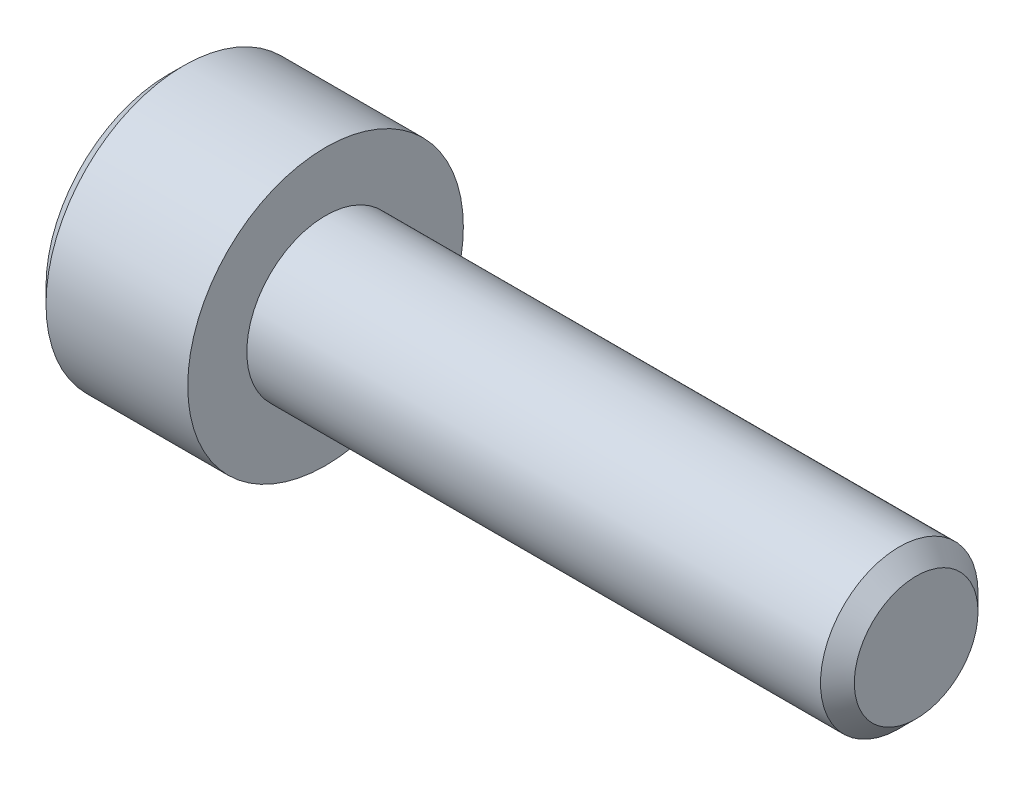
ISO-10303-21;
HEADER;
FILE_DESCRIPTION(('STEP AP214'),'2;1');
FILE_NAME('part.step','',(''),(''),'','','');
FILE_SCHEMA(('AUTOMOTIVE_DESIGN { 1 0 10303 214 1 1 1 1 }'));
ENDSEC;
DATA;
#1=APPLICATION_CONTEXT('core data for automotive mechanical design processes');
#2=APPLICATION_PROTOCOL_DEFINITION('international standard','automotive_design',2000,#1);
#3=PRODUCT_CONTEXT('',#1,'mechanical');
#4=PRODUCT('Part','Part','',(#3));
#5=PRODUCT_RELATED_PRODUCT_CATEGORY('part','',(#4));
#6=PRODUCT_DEFINITION_FORMATION('','',#4);
#7=PRODUCT_DEFINITION_CONTEXT('part definition',#1,'design');
#8=PRODUCT_DEFINITION('design','',#6,#7);
#9=PRODUCT_DEFINITION_SHAPE('','',#8);
#10=(LENGTH_UNIT() NAMED_UNIT(*) SI_UNIT(.MILLI.,.METRE.));
#11=(NAMED_UNIT(*) PLANE_ANGLE_UNIT() SI_UNIT($,.RADIAN.));
#12=(NAMED_UNIT(*) SI_UNIT($,.STERADIAN.) SOLID_ANGLE_UNIT());
#13=UNCERTAINTY_MEASURE_WITH_UNIT(LENGTH_MEASURE(1.E-05),#10,'distance_accuracy_value','');
#14=(GEOMETRIC_REPRESENTATION_CONTEXT(3) GLOBAL_UNCERTAINTY_ASSIGNED_CONTEXT((#13)) GLOBAL_UNIT_ASSIGNED_CONTEXT((#10,
#11,#12)) REPRESENTATION_CONTEXT('',''));
#15=CARTESIAN_POINT('',(0.,0.,0.));
#16=DIRECTION('',(0.,0.,1.));
#17=DIRECTION('',(1.,0.,0.));
#18=AXIS2_PLACEMENT_3D('',#15,#16,#17);
#19=CARTESIAN_POINT('',(-2.,0.,0.));
#20=DIRECTION('',(-1.,0.,0.));
#21=DIRECTION('',(0.,0.,1.));
#22=AXIS2_PLACEMENT_3D('',#19,#20,#21);
#23=CONICAL_SURFACE('',#22,1.5,1.30899693899575);
#24=CARTESIAN_POINT('',(-2.,0.,0.));
#25=DIRECTION('',(1.,0.,0.));
#26=DIRECTION('',(0.,0.,-1.));
#27=AXIS2_PLACEMENT_3D('',#24,#25,#26);
#28=CIRCLE('',#27,1.5);
#29=CARTESIAN_POINT('',(-2.,1.29903810567666,-0.75));
#30=VERTEX_POINT('',#29);
#31=CARTESIAN_POINT('',(-2.,1.29903810567666,0.75));
#32=VERTEX_POINT('',#31);
#33=EDGE_CURVE('E213',#30,#32,#28,.T.);
#34=ORIENTED_EDGE('',*,*,#33,.F.);
#35=CARTESIAN_POINT('',(-2.,0.,0.));
#36=DIRECTION('',(1.,0.,0.));
#37=DIRECTION('',(0.,0.,-1.));
#38=AXIS2_PLACEMENT_3D('',#35,#36,#37);
#39=CIRCLE('',#38,1.5);
#40=CARTESIAN_POINT('',(-2.,0.,-1.5));
#41=VERTEX_POINT('',#40);
#42=EDGE_CURVE('E117',#41,#30,#39,.T.);
#43=ORIENTED_EDGE('',*,*,#42,.F.);
#44=CARTESIAN_POINT('',(-2.,0.,0.));
#45=DIRECTION('',(1.,0.,0.));
#46=DIRECTION('',(0.,0.,-1.));
#47=AXIS2_PLACEMENT_3D('',#44,#45,#46);
#48=CIRCLE('',#47,1.5);
#49=CARTESIAN_POINT('',(-2.,-1.29903810567666,-0.75));
#50=VERTEX_POINT('',#49);
#51=EDGE_CURVE('E10',#50,#41,#48,.T.);
#52=ORIENTED_EDGE('',*,*,#51,.F.);
#53=CARTESIAN_POINT('',(-2.,0.,0.));
#54=DIRECTION('',(1.,0.,0.));
#55=DIRECTION('',(0.,0.,-1.));
#56=AXIS2_PLACEMENT_3D('',#53,#54,#55);
#57=CIRCLE('',#56,1.5);
#58=CARTESIAN_POINT('',(-2.,-1.29903810567666,0.75));
#59=VERTEX_POINT('',#58);
#60=EDGE_CURVE('E26',#59,#50,#57,.T.);
#61=ORIENTED_EDGE('',*,*,#60,.F.);
#62=CARTESIAN_POINT('',(-2.,0.,0.));
#63=DIRECTION('',(1.,0.,0.));
#64=DIRECTION('',(0.,0.,-1.));
#65=AXIS2_PLACEMENT_3D('',#62,#63,#64);
#66=CIRCLE('',#65,1.5);
#67=CARTESIAN_POINT('',(-2.,0.,1.5));
#68=VERTEX_POINT('',#67);
#69=EDGE_CURVE('E131',#68,#59,#66,.T.);
#70=ORIENTED_EDGE('',*,*,#69,.F.);
#71=CARTESIAN_POINT('',(-2.,0.,0.));
#72=DIRECTION('',(1.,0.,0.));
#73=DIRECTION('',(0.,0.,-1.));
#74=AXIS2_PLACEMENT_3D('',#71,#72,#73);
#75=CIRCLE('',#74,1.5);
#76=EDGE_CURVE('E40',#32,#68,#75,.T.);
#77=ORIENTED_EDGE('',*,*,#76,.F.);
#78=EDGE_LOOP('',(#34,#43,#52,#61,#70,#77));
#79=FACE_BOUND('',#78,.T.);
#80=CARTESIAN_POINT('',(-1.59807621135332,0.,0.));
#81=VERTEX_POINT('',#80);
#82=VERTEX_LOOP('',#81);
#83=FACE_BOUND('',#82,.T.);
#84=ADVANCED_FACE('F15',(#79,#83),#23,.F.);
#85=CARTESIAN_POINT('',(-2.,0.,0.));
#86=DIRECTION('',(1.,0.,0.));
#87=DIRECTION('',(0.,1.,0.));
#88=AXIS2_PLACEMENT_3D('',#85,#86,#87);
#89=PLANE('',#88);
#90=ORIENTED_EDGE('',*,*,#51,.T.);
#91=DIRECTION('',(0.,1.,0.));
#92=VECTOR('',#91,1.);
#93=CARTESIAN_POINT('',(-2.,-0.866025403784439,-1.5));
#94=LINE('',#93,#92);
#95=CARTESIAN_POINT('',(-2.,-0.866025403784439,-1.5));
#96=VERTEX_POINT('',#95);
#97=EDGE_CURVE('E137',#96,#41,#94,.T.);
#98=ORIENTED_EDGE('',*,*,#97,.F.);
#99=DIRECTION('',(0.,0.5,-0.866025403784439));
#100=VECTOR('',#99,1.);
#101=CARTESIAN_POINT('',(-2.,-1.73205080756888,0.));
#102=LINE('',#101,#100);
#103=EDGE_CURVE('E134',#50,#96,#102,.T.);
#104=ORIENTED_EDGE('',*,*,#103,.F.);
#105=EDGE_LOOP('',(#90,#98,#104));
#106=FACE_BOUND('',#105,.T.);
#107=ADVANCED_FACE('F135',(#106),#89,.F.);
#108=CARTESIAN_POINT('',(-2.,0.,0.));
#109=DIRECTION('',(1.,0.,0.));
#110=DIRECTION('',(0.,1.,0.));
#111=AXIS2_PLACEMENT_3D('',#108,#109,#110);
#112=PLANE('',#111);
#113=ORIENTED_EDGE('',*,*,#60,.T.);
#114=DIRECTION('',(0.,0.5,-0.866025403784439));
#115=VECTOR('',#114,1.);
#116=CARTESIAN_POINT('',(-2.,-1.73205080756888,0.));
#117=LINE('',#116,#115);
#118=CARTESIAN_POINT('',(-2.,-1.73205080756888,0.));
#119=VERTEX_POINT('',#118);
#120=EDGE_CURVE('E125',#119,#50,#117,.T.);
#121=ORIENTED_EDGE('',*,*,#120,.F.);
#122=DIRECTION('',(0.,-0.5,-0.866025403784439));
#123=VECTOR('',#122,1.);
#124=CARTESIAN_POINT('',(-2.,-0.866025403784439,1.5));
#125=LINE('',#124,#123);
#126=EDGE_CURVE('E128',#59,#119,#125,.T.);
#127=ORIENTED_EDGE('',*,*,#126,.F.);
#128=EDGE_LOOP('',(#113,#121,#127));
#129=FACE_BOUND('',#128,.T.);
#130=ADVANCED_FACE('F123',(#129),#112,.F.);
#131=CARTESIAN_POINT('',(-2.,0.,0.));
#132=DIRECTION('',(1.,0.,0.));
#133=DIRECTION('',(0.,1.,0.));
#134=AXIS2_PLACEMENT_3D('',#131,#132,#133);
#135=PLANE('',#134);
#136=ORIENTED_EDGE('',*,*,#69,.T.);
#137=DIRECTION('',(0.,-0.5,-0.866025403784439));
#138=VECTOR('',#137,1.);
#139=CARTESIAN_POINT('',(-2.,-0.866025403784439,1.5));
#140=LINE('',#139,#138);
#141=CARTESIAN_POINT('',(-2.,-0.866025403784439,1.5));
#142=VERTEX_POINT('',#141);
#143=EDGE_CURVE('E157',#142,#59,#140,.T.);
#144=ORIENTED_EDGE('',*,*,#143,.F.);
#145=DIRECTION('',(0.,-1.,0.));
#146=VECTOR('',#145,1.);
#147=CARTESIAN_POINT('',(-2.,0.866025403784439,1.5));
#148=LINE('',#147,#146);
#149=EDGE_CURVE('E164',#68,#142,#148,.T.);
#150=ORIENTED_EDGE('',*,*,#149,.F.);
#151=EDGE_LOOP('',(#136,#144,#150));
#152=FACE_BOUND('',#151,.T.);
#153=ADVANCED_FACE('F342',(#152),#135,.F.);
#154=CARTESIAN_POINT('',(-2.,0.,0.));
#155=DIRECTION('',(1.,0.,0.));
#156=DIRECTION('',(0.,1.,0.));
#157=AXIS2_PLACEMENT_3D('',#154,#155,#156);
#158=PLANE('',#157);
#159=ORIENTED_EDGE('',*,*,#76,.T.);
#160=DIRECTION('',(0.,-1.,0.));
#161=VECTOR('',#160,1.);
#162=CARTESIAN_POINT('',(-2.,0.866025403784439,1.5));
#163=LINE('',#162,#161);
#164=CARTESIAN_POINT('',(-2.,0.866025403784439,1.5));
#165=VERTEX_POINT('',#164);
#166=EDGE_CURVE('E155',#165,#68,#163,.T.);
#167=ORIENTED_EDGE('',*,*,#166,.F.);
#168=DIRECTION('',(0.,-0.5,0.866025403784439));
#169=VECTOR('',#168,1.);
#170=CARTESIAN_POINT('',(-2.,1.73205080756888,0.));
#171=LINE('',#170,#169);
#172=EDGE_CURVE('E247',#32,#165,#171,.T.);
#173=ORIENTED_EDGE('',*,*,#172,.F.);
#174=EDGE_LOOP('',(#159,#167,#173));
#175=FACE_BOUND('',#174,.T.);
#176=ADVANCED_FACE('F345',(#175),#158,.F.);
#177=CARTESIAN_POINT('',(-2.,0.,0.));
#178=DIRECTION('',(1.,0.,0.));
#179=DIRECTION('',(0.,1.,0.));
#180=AXIS2_PLACEMENT_3D('',#177,#178,#179);
#181=PLANE('',#180);
#182=DIRECTION('',(0.,0.5,0.866025403784439));
#183=VECTOR('',#182,1.);
#184=CARTESIAN_POINT('',(-2.,0.866025403784439,-1.5));
#185=LINE('',#184,#183);
#186=CARTESIAN_POINT('',(-2.,1.73205080756888,0.));
#187=VERTEX_POINT('',#186);
#188=EDGE_CURVE('E181',#30,#187,#185,.T.);
#189=ORIENTED_EDGE('',*,*,#188,.F.);
#190=ORIENTED_EDGE('',*,*,#33,.T.);
#191=DIRECTION('',(0.,-0.5,0.866025403784439));
#192=VECTOR('',#191,1.);
#193=CARTESIAN_POINT('',(-2.,1.73205080756888,0.));
#194=LINE('',#193,#192);
#195=EDGE_CURVE('E202',#187,#32,#194,.T.);
#196=ORIENTED_EDGE('',*,*,#195,.F.);
#197=EDGE_LOOP('',(#189,#190,#196));
#198=FACE_BOUND('',#197,.T.);
#199=ADVANCED_FACE('F340',(#198),#181,.F.);
#200=CARTESIAN_POINT('',(-2.,0.,0.));
#201=DIRECTION('',(1.,0.,0.));
#202=DIRECTION('',(0.,1.,0.));
#203=AXIS2_PLACEMENT_3D('',#200,#201,#202);
#204=PLANE('',#203);
#205=ORIENTED_EDGE('',*,*,#42,.T.);
#206=DIRECTION('',(0.,0.5,0.866025403784439));
#207=VECTOR('',#206,1.);
#208=CARTESIAN_POINT('',(-2.,0.866025403784439,-1.5));
#209=LINE('',#208,#207);
#210=CARTESIAN_POINT('',(-2.,0.866025403784438,-1.5));
#211=VERTEX_POINT('',#210);
#212=EDGE_CURVE('E186',#211,#30,#209,.T.);
#213=ORIENTED_EDGE('',*,*,#212,.F.);
#214=DIRECTION('',(0.,1.,0.));
#215=VECTOR('',#214,1.);
#216=CARTESIAN_POINT('',(-2.,-0.866025403784439,-1.5));
#217=LINE('',#216,#215);
#218=EDGE_CURVE('E163',#41,#211,#217,.T.);
#219=ORIENTED_EDGE('',*,*,#218,.F.);
#220=EDGE_LOOP('',(#205,#213,#219));
#221=FACE_BOUND('',#220,.T.);
#222=ADVANCED_FACE('F335',(#221),#204,.F.);
#223=CARTESIAN_POINT('',(-2.,1.73205080756888,0.));
#224=DIRECTION('',(0.,-0.866025403784439,-0.5));
#225=DIRECTION('',(0.,0.5,-0.866025403784439));
#226=AXIS2_PLACEMENT_3D('',#223,#224,#225);
#227=PLANE('',#226);
#228=DIRECTION('',(0.,-0.5,0.866025403784439));
#229=VECTOR('',#228,1.);
#230=CARTESIAN_POINT('',(-4.,1.73205080756888,0.));
#231=LINE('',#230,#229);
#232=CARTESIAN_POINT('',(-4.,1.73205080756888,0.));
#233=VERTEX_POINT('',#232);
#234=CARTESIAN_POINT('',(-4.,0.866025403784439,1.5));
#235=VERTEX_POINT('',#234);
#236=EDGE_CURVE('E174',#233,#235,#231,.T.);
#237=ORIENTED_EDGE('',*,*,#236,.F.);
#238=DIRECTION('',(-1.,0.,0.));
#239=VECTOR('',#238,1.);
#240=CARTESIAN_POINT('',(-2.,1.73205080756888,0.));
#241=LINE('',#240,#239);
#242=EDGE_CURVE('E185',#187,#233,#241,.T.);
#243=ORIENTED_EDGE('',*,*,#242,.F.);
#244=ORIENTED_EDGE('',*,*,#195,.T.);
#245=ORIENTED_EDGE('',*,*,#172,.T.);
#246=DIRECTION('',(-1.,0.,0.));
#247=VECTOR('',#246,1.);
#248=CARTESIAN_POINT('',(-2.,0.866025403784439,1.5));
#249=LINE('',#248,#247);
#250=EDGE_CURVE('E219',#165,#235,#249,.T.);
#251=ORIENTED_EDGE('',*,*,#250,.T.);
#252=EDGE_LOOP('',(#237,#243,#244,#245,#251));
#253=FACE_BOUND('',#252,.T.);
#254=ADVANCED_FACE('F274',(#253),#227,.T.);
#255=CARTESIAN_POINT('',(-2.,0.866025403784439,-1.5));
#256=DIRECTION('',(0.,-0.866025403784439,0.5));
#257=DIRECTION('',(-1.,0.,0.));
#258=AXIS2_PLACEMENT_3D('',#255,#256,#257);
#259=PLANE('',#258);
#260=DIRECTION('',(0.,0.5,0.866025403784439));
#261=VECTOR('',#260,1.);
#262=CARTESIAN_POINT('',(-4.,0.866025403784439,-1.5));
#263=LINE('',#262,#261);
#264=CARTESIAN_POINT('',(-4.,0.866025403784438,-1.5));
#265=VERTEX_POINT('',#264);
#266=EDGE_CURVE('E172',#265,#233,#263,.T.);
#267=ORIENTED_EDGE('',*,*,#266,.F.);
#268=DIRECTION('',(-1.,0.,0.));
#269=VECTOR('',#268,1.);
#270=CARTESIAN_POINT('',(-2.,0.866025403784438,-1.5));
#271=LINE('',#270,#269);
#272=EDGE_CURVE('E210',#211,#265,#271,.T.);
#273=ORIENTED_EDGE('',*,*,#272,.F.);
#274=ORIENTED_EDGE('',*,*,#212,.T.);
#275=ORIENTED_EDGE('',*,*,#188,.T.);
#276=ORIENTED_EDGE('',*,*,#242,.T.);
#277=EDGE_LOOP('',(#267,#273,#274,#275,#276));
#278=FACE_BOUND('',#277,.T.);
#279=ADVANCED_FACE('F334',(#278),#259,.T.);
#280=CARTESIAN_POINT('',(-2.,-0.866025403784439,-1.5));
#281=DIRECTION('',(0.,0.,1.));
#282=DIRECTION('',(1.,0.,0.));
#283=AXIS2_PLACEMENT_3D('',#280,#281,#282);
#284=PLANE('',#283);
#285=DIRECTION('',(0.,1.,0.));
#286=VECTOR('',#285,1.);
#287=CARTESIAN_POINT('',(-4.,-0.866025403784439,-1.5));
#288=LINE('',#287,#286);
#289=CARTESIAN_POINT('',(-4.,-0.866025403784439,-1.5));
#290=VERTEX_POINT('',#289);
#291=EDGE_CURVE('E168',#290,#265,#288,.T.);
#292=ORIENTED_EDGE('',*,*,#291,.F.);
#293=DIRECTION('',(-1.,0.,0.));
#294=VECTOR('',#293,1.);
#295=CARTESIAN_POINT('',(-2.,-0.866025403784439,-1.5));
#296=LINE('',#295,#294);
#297=EDGE_CURVE('E141',#96,#290,#296,.T.);
#298=ORIENTED_EDGE('',*,*,#297,.F.);
#299=ORIENTED_EDGE('',*,*,#97,.T.);
#300=ORIENTED_EDGE('',*,*,#218,.T.);
#301=ORIENTED_EDGE('',*,*,#272,.T.);
#302=EDGE_LOOP('',(#292,#298,#299,#300,#301));
#303=FACE_BOUND('',#302,.T.);
#304=ADVANCED_FACE('F304',(#303),#284,.T.);
#305=CARTESIAN_POINT('',(-2.,-1.73205080756888,0.));
#306=DIRECTION('',(0.,0.866025403784439,0.5));
#307=DIRECTION('',(1.,0.,0.));
#308=AXIS2_PLACEMENT_3D('',#305,#306,#307);
#309=PLANE('',#308);
#310=DIRECTION('',(0.,0.5,-0.866025403784439));
#311=VECTOR('',#310,1.);
#312=CARTESIAN_POINT('',(-4.,-1.73205080756888,0.));
#313=LINE('',#312,#311);
#314=CARTESIAN_POINT('',(-4.,-1.73205080756888,0.));
#315=VERTEX_POINT('',#314);
#316=EDGE_CURVE('E173',#315,#290,#313,.T.);
#317=ORIENTED_EDGE('',*,*,#316,.F.);
#318=DIRECTION('',(-1.,0.,0.));
#319=VECTOR('',#318,1.);
#320=CARTESIAN_POINT('',(-2.,-1.73205080756888,0.));
#321=LINE('',#320,#319);
#322=EDGE_CURVE('E145',#119,#315,#321,.T.);
#323=ORIENTED_EDGE('',*,*,#322,.F.);
#324=ORIENTED_EDGE('',*,*,#120,.T.);
#325=ORIENTED_EDGE('',*,*,#103,.T.);
#326=ORIENTED_EDGE('',*,*,#297,.T.);
#327=EDGE_LOOP('',(#317,#323,#324,#325,#326));
#328=FACE_BOUND('',#327,.T.);
#329=ADVANCED_FACE('F144',(#328),#309,.T.);
#330=CARTESIAN_POINT('',(-2.,-0.866025403784439,1.5));
#331=DIRECTION('',(0.,0.866025403784439,-0.5));
#332=DIRECTION('',(-1.,0.,0.));
#333=AXIS2_PLACEMENT_3D('',#330,#331,#332);
#334=PLANE('',#333);
#335=DIRECTION('',(0.,-0.5,-0.866025403784439));
#336=VECTOR('',#335,1.);
#337=CARTESIAN_POINT('',(-4.,-0.866025403784439,1.5));
#338=LINE('',#337,#336);
#339=CARTESIAN_POINT('',(-4.,-0.866025403784439,1.5));
#340=VERTEX_POINT('',#339);
#341=EDGE_CURVE('E187',#340,#315,#338,.T.);
#342=ORIENTED_EDGE('',*,*,#341,.F.);
#343=DIRECTION('',(-1.,0.,0.));
#344=VECTOR('',#343,1.);
#345=CARTESIAN_POINT('',(-2.,-0.866025403784439,1.5));
#346=LINE('',#345,#344);
#347=EDGE_CURVE('E160',#142,#340,#346,.T.);
#348=ORIENTED_EDGE('',*,*,#347,.F.);
#349=ORIENTED_EDGE('',*,*,#143,.T.);
#350=ORIENTED_EDGE('',*,*,#126,.T.);
#351=ORIENTED_EDGE('',*,*,#322,.T.);
#352=EDGE_LOOP('',(#342,#348,#349,#350,#351));
#353=FACE_BOUND('',#352,.T.);
#354=ADVANCED_FACE('F17',(#353),#334,.T.);
#355=CARTESIAN_POINT('',(-2.,0.866025403784439,1.5));
#356=DIRECTION('',(0.,0.,-1.));
#357=DIRECTION('',(0.,-1.,0.));
#358=AXIS2_PLACEMENT_3D('',#355,#356,#357);
#359=PLANE('',#358);
#360=DIRECTION('',(0.,-1.,0.));
#361=VECTOR('',#360,1.);
#362=CARTESIAN_POINT('',(-4.,0.866025403784439,1.5));
#363=LINE('',#362,#361);
#364=EDGE_CURVE('E178',#235,#340,#363,.T.);
#365=ORIENTED_EDGE('',*,*,#364,.F.);
#366=ORIENTED_EDGE('',*,*,#250,.F.);
#367=ORIENTED_EDGE('',*,*,#166,.T.);
#368=ORIENTED_EDGE('',*,*,#149,.T.);
#369=ORIENTED_EDGE('',*,*,#347,.T.);
#370=EDGE_LOOP('',(#365,#366,#367,#368,#369));
#371=FACE_BOUND('',#370,.T.);
#372=ADVANCED_FACE('F263',(#371),#359,.T.);
#373=CARTESIAN_POINT('',(15.,1.5705,0.));
#374=DIRECTION('',(-1.,0.,0.));
#375=DIRECTION('',(0.,0.,1.));
#376=AXIS2_PLACEMENT_3D('',#373,#374,#375);
#377=PLANE('',#376);
#378=CARTESIAN_POINT('',(15.,0.,0.));
#379=DIRECTION('',(1.,0.,0.));
#380=DIRECTION('',(0.,0.,-1.));
#381=AXIS2_PLACEMENT_3D('',#378,#379,#380);
#382=CIRCLE('',#381,1.5705);
#383=CARTESIAN_POINT('',(15.,0.,-1.5705));
#384=VERTEX_POINT('',#383);
#385=EDGE_CURVE('E195',#384,#384,#382,.T.);
#386=ORIENTED_EDGE('',*,*,#385,.T.);
#387=EDGE_LOOP('',(#386));
#388=FACE_BOUND('',#387,.T.);
#389=ADVANCED_FACE('F318',(#388),#377,.F.);
#390=CARTESIAN_POINT('',(14.5705,0.,0.));
#391=DIRECTION('',(-1.,0.,0.));
#392=DIRECTION('',(0.,0.,1.));
#393=AXIS2_PLACEMENT_3D('',#390,#391,#392);
#394=CONICAL_SURFACE('',#393,2.,0.785398163397449);
#395=CARTESIAN_POINT('',(14.5705,0.,0.));
#396=DIRECTION('',(1.,0.,0.));
#397=DIRECTION('',(0.,0.,-1.));
#398=AXIS2_PLACEMENT_3D('',#395,#396,#397);
#399=CIRCLE('',#398,2.);
#400=CARTESIAN_POINT('',(14.5705,0.,-2.));
#401=VERTEX_POINT('',#400);
#402=EDGE_CURVE('E192',#401,#401,#399,.T.);
#403=ORIENTED_EDGE('',*,*,#402,.T.);
#404=EDGE_LOOP('',(#403));
#405=FACE_BOUND('',#404,.T.);
#406=ORIENTED_EDGE('',*,*,#385,.F.);
#407=EDGE_LOOP('',(#406));
#408=FACE_BOUND('',#407,.T.);
#409=ADVANCED_FACE('F310',(#405,#408),#394,.T.);
#410=CARTESIAN_POINT('',(15.,0.,0.));
#411=DIRECTION('',(1.,0.,0.));
#412=DIRECTION('',(0.,0.,-1.));
#413=AXIS2_PLACEMENT_3D('',#410,#411,#412);
#414=CYLINDRICAL_SURFACE('',#413,2.);
#415=CARTESIAN_POINT('',(0.,0.,0.));
#416=DIRECTION('',(1.,0.,0.));
#417=DIRECTION('',(0.,0.,-1.));
#418=AXIS2_PLACEMENT_3D('',#415,#416,#417);
#419=CIRCLE('',#418,2.);
#420=CARTESIAN_POINT('',(0.,0.,-2.));
#421=VERTEX_POINT('',#420);
#422=EDGE_CURVE('E196',#421,#421,#419,.T.);
#423=ORIENTED_EDGE('',*,*,#422,.T.);
#424=EDGE_LOOP('',(#423));
#425=FACE_BOUND('',#424,.T.);
#426=ORIENTED_EDGE('',*,*,#402,.F.);
#427=EDGE_LOOP('',(#426));
#428=FACE_BOUND('',#427,.T.);
#429=ADVANCED_FACE('F306',(#425,#428),#414,.T.);
#430=CARTESIAN_POINT('',(0.,3.5,0.));
#431=DIRECTION('',(-1.,0.,0.));
#432=DIRECTION('',(0.,0.,1.));
#433=AXIS2_PLACEMENT_3D('',#430,#431,#432);
#434=PLANE('',#433);
#435=CARTESIAN_POINT('',(0.,0.,0.));
#436=DIRECTION('',(1.,0.,0.));
#437=DIRECTION('',(0.,0.,-1.));
#438=AXIS2_PLACEMENT_3D('',#435,#436,#437);
#439=CIRCLE('',#438,3.5);
#440=CARTESIAN_POINT('',(0.,0.,-3.5));
#441=VERTEX_POINT('',#440);
#442=EDGE_CURVE('E19',#441,#441,#439,.T.);
#443=ORIENTED_EDGE('',*,*,#442,.T.);
#444=EDGE_LOOP('',(#443));
#445=FACE_BOUND('',#444,.T.);
#446=ORIENTED_EDGE('',*,*,#422,.F.);
#447=EDGE_LOOP('',(#446));
#448=FACE_BOUND('',#447,.T.);
#449=ADVANCED_FACE('F309',(#445,#448),#434,.F.);
#450=CARTESIAN_POINT('',(15.,0.,0.));
#451=DIRECTION('',(1.,0.,0.));
#452=DIRECTION('',(0.,0.,-1.));
#453=AXIS2_PLACEMENT_3D('',#450,#451,#452);
#454=CYLINDRICAL_SURFACE('',#453,3.5);
#455=CARTESIAN_POINT('',(-3.6,0.,0.));
#456=DIRECTION('',(1.,0.,0.));
#457=DIRECTION('',(0.,0.,-1.));
#458=AXIS2_PLACEMENT_3D('',#455,#456,#457);
#459=CIRCLE('',#458,3.5);
#460=CARTESIAN_POINT('',(-3.6,0.,-3.5));
#461=VERTEX_POINT('',#460);
#462=EDGE_CURVE('E191',#461,#461,#459,.T.);
#463=ORIENTED_EDGE('',*,*,#462,.T.);
#464=EDGE_LOOP('',(#463));
#465=FACE_BOUND('',#464,.T.);
#466=ORIENTED_EDGE('',*,*,#442,.F.);
#467=EDGE_LOOP('',(#466));
#468=FACE_BOUND('',#467,.T.);
#469=ADVANCED_FACE('F314',(#465,#468),#454,.T.);
#470=CARTESIAN_POINT('',(-4.,0.,0.));
#471=DIRECTION('',(1.,0.,0.));
#472=DIRECTION('',(0.,0.,-1.));
#473=AXIS2_PLACEMENT_3D('',#470,#471,#472);
#474=CONICAL_SURFACE('',#473,3.1,0.785398163397447);
#475=CARTESIAN_POINT('',(-4.,0.,0.));
#476=DIRECTION('',(1.,0.,0.));
#477=DIRECTION('',(0.,0.,-1.));
#478=AXIS2_PLACEMENT_3D('',#475,#476,#477);
#479=CIRCLE('',#478,3.1);
#480=CARTESIAN_POINT('',(-4.,0.,-3.1));
#481=VERTEX_POINT('',#480);
#482=EDGE_CURVE('E225',#481,#481,#479,.T.);
#483=ORIENTED_EDGE('',*,*,#482,.T.);
#484=EDGE_LOOP('',(#483));
#485=FACE_BOUND('',#484,.T.);
#486=ORIENTED_EDGE('',*,*,#462,.F.);
#487=EDGE_LOOP('',(#486));
#488=FACE_BOUND('',#487,.T.);
#489=ADVANCED_FACE('F319',(#485,#488),#474,.T.);
#490=CARTESIAN_POINT('',(-4.,0.,0.));
#491=DIRECTION('',(1.,0.,0.));
#492=DIRECTION('',(0.,1.,0.));
#493=AXIS2_PLACEMENT_3D('',#490,#491,#492);
#494=PLANE('',#493);
#495=ORIENTED_EDGE('',*,*,#316,.T.);
#496=ORIENTED_EDGE('',*,*,#291,.T.);
#497=ORIENTED_EDGE('',*,*,#266,.T.);
#498=ORIENTED_EDGE('',*,*,#236,.T.);
#499=ORIENTED_EDGE('',*,*,#364,.T.);
#500=ORIENTED_EDGE('',*,*,#341,.T.);
#501=EDGE_LOOP('',(#495,#496,#497,#498,#499,#500));
#502=FACE_BOUND('',#501,.T.);
#503=ORIENTED_EDGE('',*,*,#482,.F.);
#504=EDGE_LOOP('',(#503));
#505=FACE_BOUND('',#504,.T.);
#506=ADVANCED_FACE('F269',(#502,#505),#494,.F.);
#507=CLOSED_SHELL('',(#84,#107,#130,#153,#176,#199,#222,#254,#279,#304,#329,#354,#372,#389,#409,
#429,#449,#469,#489,#506));
#508=MANIFOLD_SOLID_BREP('B1',#507);
#509=ADVANCED_BREP_SHAPE_REPRESENTATION('',(#18,#508),#14);
#510=SHAPE_DEFINITION_REPRESENTATION(#9,#509);
ENDSEC;
END-ISO-10303-21;
